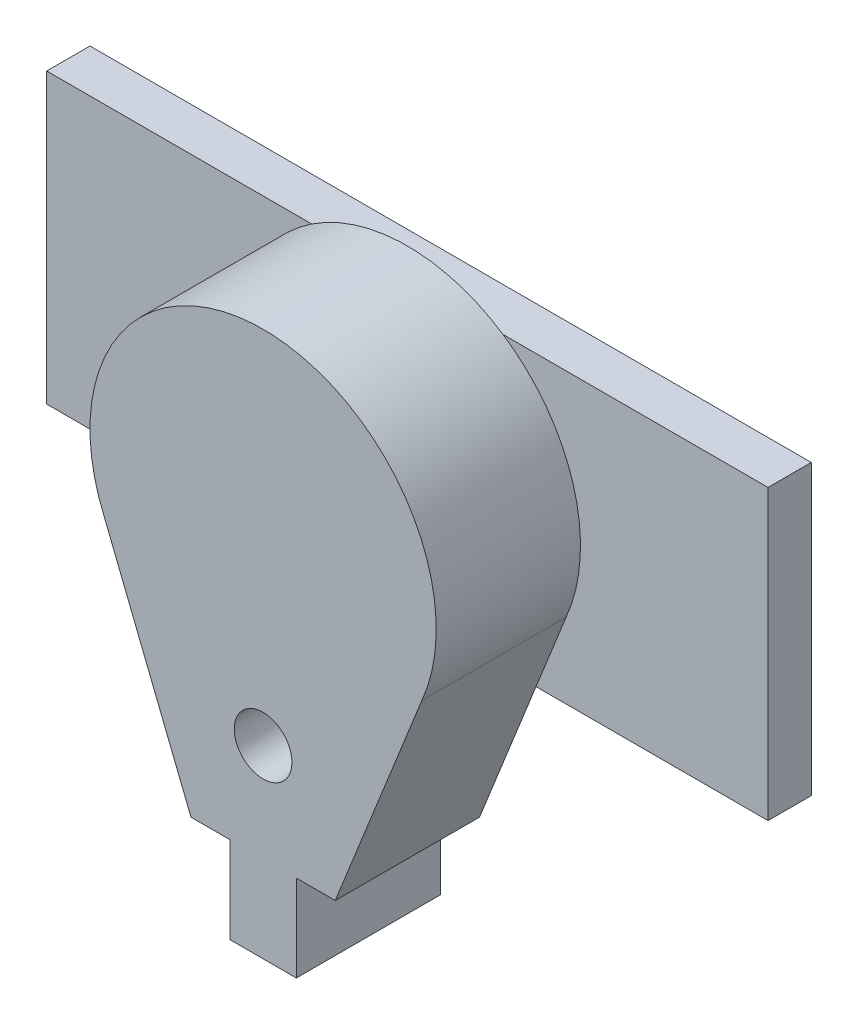
ISO-10303-21;
HEADER;
FILE_DESCRIPTION(('STEP AP214'),'2;1');
FILE_NAME('part.step','',(''),(''),'','','');
FILE_SCHEMA(('AUTOMOTIVE_DESIGN { 1 0 10303 214 1 1 1 1 }'));
ENDSEC;
DATA;
#1=APPLICATION_CONTEXT('core data for automotive mechanical design processes');
#2=APPLICATION_PROTOCOL_DEFINITION('international standard','automotive_design',2000,#1);
#3=PRODUCT_CONTEXT('',#1,'mechanical');
#4=PRODUCT('Part','Part','',(#3));
#5=PRODUCT_RELATED_PRODUCT_CATEGORY('part','',(#4));
#6=PRODUCT_DEFINITION_FORMATION('','',#4);
#7=PRODUCT_DEFINITION_CONTEXT('part definition',#1,'design');
#8=PRODUCT_DEFINITION('design','',#6,#7);
#9=PRODUCT_DEFINITION_SHAPE('','',#8);
#10=(LENGTH_UNIT() NAMED_UNIT(*) SI_UNIT(.MILLI.,.METRE.));
#11=(NAMED_UNIT(*) PLANE_ANGLE_UNIT() SI_UNIT($,.RADIAN.));
#12=(NAMED_UNIT(*) SI_UNIT($,.STERADIAN.) SOLID_ANGLE_UNIT());
#13=UNCERTAINTY_MEASURE_WITH_UNIT(LENGTH_MEASURE(1.E-05),#10,'distance_accuracy_value','');
#14=(GEOMETRIC_REPRESENTATION_CONTEXT(3) GLOBAL_UNCERTAINTY_ASSIGNED_CONTEXT((#13)) GLOBAL_UNIT_ASSIGNED_CONTEXT((#10,
#11,#12)) REPRESENTATION_CONTEXT('',''));
#15=CARTESIAN_POINT('',(0.,0.,0.));
#16=DIRECTION('',(0.,0.,1.));
#17=DIRECTION('',(1.,0.,0.));
#18=AXIS2_PLACEMENT_3D('',#15,#16,#17);
#19=CARTESIAN_POINT('',(0.,0.,0.));
#20=DIRECTION('',(0.,0.,-1.));
#21=DIRECTION('',(-1.,0.,0.));
#22=AXIS2_PLACEMENT_3D('',#19,#20,#21);
#23=PLANE('',#22);
#24=DIRECTION('',(-1.,0.,0.));
#25=VECTOR('',#24,1.);
#26=CARTESIAN_POINT('',(-25.,-10.,0.));
#27=LINE('',#26,#25);
#28=CARTESIAN_POINT('',(8.91833260932509,-10.,0.));
#29=VERTEX_POINT('',#28);
#30=CARTESIAN_POINT('',(-8.91833260932509,-10.,0.));
#31=VERTEX_POINT('',#30);
#32=EDGE_CURVE('E11',#29,#31,#27,.T.);
#33=ORIENTED_EDGE('',*,*,#32,.F.);
#34=DIRECTION('',(0.371390676354104,0.928476690885259,0.));
#35=VECTOR('',#34,1.);
#36=CARTESIAN_POINT('',(11.,-4.79583152331272,0.));
#37=LINE('',#36,#35);
#38=CARTESIAN_POINT('',(5.,-19.7958315233127,0.));
#39=VERTEX_POINT('',#38);
#40=EDGE_CURVE('E204',#39,#29,#37,.T.);
#41=ORIENTED_EDGE('',*,*,#40,.F.);
#42=DIRECTION('',(1.,0.,0.));
#43=VECTOR('',#42,1.);
#44=CARTESIAN_POINT('',(5.,-19.7958315233127,0.));
#45=LINE('',#44,#43);
#46=CARTESIAN_POINT('',(2.30529597079965,-19.7958315233127,0.));
#47=VERTEX_POINT('',#46);
#48=EDGE_CURVE('E218',#47,#39,#45,.T.);
#49=ORIENTED_EDGE('',*,*,#48,.F.);
#50=DIRECTION('',(0.,1.,0.));
#51=VECTOR('',#50,1.);
#52=CARTESIAN_POINT('',(2.30529597079965,-25.7958315233127,0.));
#53=LINE('',#52,#51);
#54=CARTESIAN_POINT('',(2.30529597079965,-25.7958315233127,0.));
#55=VERTEX_POINT('',#54);
#56=EDGE_CURVE('E187',#55,#47,#53,.T.);
#57=ORIENTED_EDGE('',*,*,#56,.F.);
#58=DIRECTION('',(1.,0.,0.));
#59=VECTOR('',#58,1.);
#60=CARTESIAN_POINT('',(2.30529597079965,-25.7958315233127,0.));
#61=LINE('',#60,#59);
#62=CARTESIAN_POINT('',(-2.30529597079965,-25.7958315233127,0.));
#63=VERTEX_POINT('',#62);
#64=EDGE_CURVE('E173',#63,#55,#61,.T.);
#65=ORIENTED_EDGE('',*,*,#64,.F.);
#66=DIRECTION('',(0.,1.,0.));
#67=VECTOR('',#66,1.);
#68=CARTESIAN_POINT('',(-2.30529597079965,-25.7958315233127,0.));
#69=LINE('',#68,#67);
#70=CARTESIAN_POINT('',(-2.30529597079965,-19.7958315233127,0.));
#71=VERTEX_POINT('',#70);
#72=EDGE_CURVE('E190',#63,#71,#69,.T.);
#73=ORIENTED_EDGE('',*,*,#72,.T.);
#74=CARTESIAN_POINT('',(-5.,-19.7958315233127,0.));
#75=VERTEX_POINT('',#74);
#76=EDGE_CURVE('E219',#75,#71,#45,.T.);
#77=ORIENTED_EDGE('',*,*,#76,.F.);
#78=DIRECTION('',(0.371390676354104,-0.928476690885259,0.));
#79=VECTOR('',#78,1.);
#80=CARTESIAN_POINT('',(-11.,-4.79583152331272,0.));
#81=LINE('',#80,#79);
#82=EDGE_CURVE('E52',#31,#75,#81,.T.);
#83=ORIENTED_EDGE('',*,*,#82,.F.);
#84=EDGE_LOOP('',(#33,#41,#49,#57,#65,#73,#77,#83));
#85=FACE_BOUND('',#84,.T.);
#86=CARTESIAN_POINT('',(0.,-13.,0.));
#87=DIRECTION('',(0.,0.,-1.));
#88=DIRECTION('',(-1.,0.,0.));
#89=AXIS2_PLACEMENT_3D('',#86,#87,#88);
#90=CIRCLE('',#89,2.);
#91=CARTESIAN_POINT('',(-2.,-13.,0.));
#92=VERTEX_POINT('',#91);
#93=EDGE_CURVE('E193',#92,#92,#90,.T.);
#94=ORIENTED_EDGE('',*,*,#93,.F.);
#95=EDGE_LOOP('',(#94));
#96=FACE_BOUND('',#95,.T.);
#97=ADVANCED_FACE('F33',(#85,#96),#23,.T.);
#98=CARTESIAN_POINT('',(5.,-19.7958315233127,10.));
#99=DIRECTION('',(0.,1.,0.));
#100=DIRECTION('',(0.,0.,1.));
#101=AXIS2_PLACEMENT_3D('',#98,#99,#100);
#102=PLANE('',#101);
#103=DIRECTION('',(0.,0.,-1.));
#104=VECTOR('',#103,1.);
#105=CARTESIAN_POINT('',(-2.30529597079965,-19.7958315233127,10.));
#106=LINE('',#105,#104);
#107=CARTESIAN_POINT('',(-2.30529597079965,-19.7958315233127,10.));
#108=VERTEX_POINT('',#107);
#109=EDGE_CURVE('E161',#108,#71,#106,.T.);
#110=ORIENTED_EDGE('',*,*,#109,.F.);
#111=DIRECTION('',(1.,0.,0.));
#112=VECTOR('',#111,1.);
#113=CARTESIAN_POINT('',(5.,-19.7958315233127,10.));
#114=LINE('',#113,#112);
#115=CARTESIAN_POINT('',(-5.,-19.7958315233127,10.));
#116=VERTEX_POINT('',#115);
#117=EDGE_CURVE('E207',#116,#108,#114,.T.);
#118=ORIENTED_EDGE('',*,*,#117,.F.);
#119=DIRECTION('',(0.,0.,-1.));
#120=VECTOR('',#119,1.);
#121=CARTESIAN_POINT('',(-5.,-19.7958315233127,10.));
#122=LINE('',#121,#120);
#123=EDGE_CURVE('E227',#116,#75,#122,.T.);
#124=ORIENTED_EDGE('',*,*,#123,.T.);
#125=ORIENTED_EDGE('',*,*,#76,.T.);
#126=EDGE_LOOP('',(#110,#118,#124,#125));
#127=FACE_BOUND('',#126,.T.);
#128=ADVANCED_FACE('F289',(#127),#102,.F.);
#129=DIRECTION('',(0.,0.,1.));
#130=VECTOR('',#129,1.);
#131=CARTESIAN_POINT('',(2.30529597079965,-19.7958315233127,10.));
#132=LINE('',#131,#130);
#133=CARTESIAN_POINT('',(2.30529597079965,-19.7958315233127,10.));
#134=VERTEX_POINT('',#133);
#135=EDGE_CURVE('E164',#47,#134,#132,.T.);
#136=ORIENTED_EDGE('',*,*,#135,.F.);
#137=ORIENTED_EDGE('',*,*,#48,.T.);
#138=DIRECTION('',(0.,0.,-1.));
#139=VECTOR('',#138,1.);
#140=CARTESIAN_POINT('',(5.,-19.7958315233127,10.));
#141=LINE('',#140,#139);
#142=CARTESIAN_POINT('',(5.,-19.7958315233127,10.));
#143=VERTEX_POINT('',#142);
#144=EDGE_CURVE('E225',#143,#39,#141,.T.);
#145=ORIENTED_EDGE('',*,*,#144,.F.);
#146=EDGE_CURVE('E206',#134,#143,#114,.T.);
#147=ORIENTED_EDGE('',*,*,#146,.F.);
#148=EDGE_LOOP('',(#136,#137,#145,#147));
#149=FACE_BOUND('',#148,.T.);
#150=ADVANCED_FACE('F291',(#149),#102,.F.);
#151=CARTESIAN_POINT('',(0.,0.,10.));
#152=DIRECTION('',(0.,0.,-1.));
#153=DIRECTION('',(-1.,0.,0.));
#154=AXIS2_PLACEMENT_3D('',#151,#152,#153);
#155=CYLINDRICAL_SURFACE('',#154,12.);
#156=CARTESIAN_POINT('',(0.,0.,0.));
#157=DIRECTION('',(0.,0.,1.));
#158=DIRECTION('',(-1.,0.,0.));
#159=AXIS2_PLACEMENT_3D('',#156,#157,#158);
#160=CIRCLE('',#159,12.);
#161=CARTESIAN_POINT('',(11.,-4.79583152331272,0.));
#162=VERTEX_POINT('',#161);
#163=CARTESIAN_POINT('',(6.6332495807108,10.,0.));
#164=VERTEX_POINT('',#163);
#165=EDGE_CURVE('E213',#162,#164,#160,.T.);
#166=ORIENTED_EDGE('',*,*,#165,.T.);
#167=CARTESIAN_POINT('',(-6.6332495807108,10.,0.));
#168=VERTEX_POINT('',#167);
#169=EDGE_CURVE('E215',#164,#168,#160,.T.);
#170=ORIENTED_EDGE('',*,*,#169,.T.);
#171=CARTESIAN_POINT('',(-11.,-4.79583152331272,0.));
#172=VERTEX_POINT('',#171);
#173=EDGE_CURVE('E197',#168,#172,#160,.T.);
#174=ORIENTED_EDGE('',*,*,#173,.T.);
#175=DIRECTION('',(0.,0.,-1.));
#176=VECTOR('',#175,1.);
#177=CARTESIAN_POINT('',(-11.,-4.79583152331272,10.));
#178=LINE('',#177,#176);
#179=CARTESIAN_POINT('',(-11.,-4.79583152331272,10.));
#180=VERTEX_POINT('',#179);
#181=EDGE_CURVE('E37',#180,#172,#178,.T.);
#182=ORIENTED_EDGE('',*,*,#181,.F.);
#183=CARTESIAN_POINT('',(0.,0.,10.));
#184=DIRECTION('',(0.,0.,1.));
#185=DIRECTION('',(-1.,0.,0.));
#186=AXIS2_PLACEMENT_3D('',#183,#184,#185);
#187=CIRCLE('',#186,12.);
#188=CARTESIAN_POINT('',(11.,-4.79583152331272,10.));
#189=VERTEX_POINT('',#188);
#190=EDGE_CURVE('E200',#189,#180,#187,.T.);
#191=ORIENTED_EDGE('',*,*,#190,.F.);
#192=DIRECTION('',(0.,0.,-1.));
#193=VECTOR('',#192,1.);
#194=CARTESIAN_POINT('',(11.,-4.79583152331272,10.));
#195=LINE('',#194,#193);
#196=EDGE_CURVE('E212',#189,#162,#195,.T.);
#197=ORIENTED_EDGE('',*,*,#196,.T.);
#198=EDGE_LOOP('',(#166,#170,#174,#182,#191,#197));
#199=FACE_BOUND('',#198,.T.);
#200=ADVANCED_FACE('F35',(#199),#155,.T.);
#201=CARTESIAN_POINT('',(-11.,-4.79583152331272,10.));
#202=DIRECTION('',(0.928476690885259,0.371390676354104,0.));
#203=DIRECTION('',(-0.371390676354104,0.928476690885259,0.));
#204=AXIS2_PLACEMENT_3D('',#201,#202,#203);
#205=PLANE('',#204);
#206=EDGE_CURVE('E216',#172,#31,#81,.T.);
#207=ORIENTED_EDGE('',*,*,#206,.T.);
#208=ORIENTED_EDGE('',*,*,#82,.T.);
#209=ORIENTED_EDGE('',*,*,#123,.F.);
#210=DIRECTION('',(0.371390676354104,-0.928476690885259,0.));
#211=VECTOR('',#210,1.);
#212=CARTESIAN_POINT('',(-11.,-4.79583152331272,10.));
#213=LINE('',#212,#211);
#214=EDGE_CURVE('E203',#180,#116,#213,.T.);
#215=ORIENTED_EDGE('',*,*,#214,.F.);
#216=ORIENTED_EDGE('',*,*,#181,.T.);
#217=EDGE_LOOP('',(#207,#208,#209,#215,#216));
#218=FACE_BOUND('',#217,.T.);
#219=ADVANCED_FACE('F300',(#218),#205,.F.);
#220=CARTESIAN_POINT('',(11.,-4.79583152331272,10.));
#221=DIRECTION('',(-0.928476690885259,0.371390676354104,0.));
#222=DIRECTION('',(-0.371390676354104,-0.928476690885259,0.));
#223=AXIS2_PLACEMENT_3D('',#220,#221,#222);
#224=PLANE('',#223);
#225=ORIENTED_EDGE('',*,*,#40,.T.);
#226=EDGE_CURVE('E221',#29,#162,#37,.T.);
#227=ORIENTED_EDGE('',*,*,#226,.T.);
#228=ORIENTED_EDGE('',*,*,#196,.F.);
#229=DIRECTION('',(0.371390676354104,0.928476690885259,0.));
#230=VECTOR('',#229,1.);
#231=CARTESIAN_POINT('',(11.,-4.79583152331272,10.));
#232=LINE('',#231,#230);
#233=EDGE_CURVE('E210',#143,#189,#232,.T.);
#234=ORIENTED_EDGE('',*,*,#233,.F.);
#235=ORIENTED_EDGE('',*,*,#144,.T.);
#236=EDGE_LOOP('',(#225,#227,#228,#234,#235));
#237=FACE_BOUND('',#236,.T.);
#238=ADVANCED_FACE('F264',(#237),#224,.F.);
#239=CARTESIAN_POINT('',(0.,0.,10.));
#240=DIRECTION('',(0.,0.,-1.));
#241=DIRECTION('',(-1.,0.,0.));
#242=AXIS2_PLACEMENT_3D('',#239,#240,#241);
#243=PLANE('',#242);
#244=CARTESIAN_POINT('',(0.,-13.,10.));
#245=DIRECTION('',(0.,0.,-1.));
#246=DIRECTION('',(-1.,0.,0.));
#247=AXIS2_PLACEMENT_3D('',#244,#245,#246);
#248=CIRCLE('',#247,2.);
#249=CARTESIAN_POINT('',(-2.,-13.,10.));
#250=VERTEX_POINT('',#249);
#251=EDGE_CURVE('E194',#250,#250,#248,.T.);
#252=ORIENTED_EDGE('',*,*,#251,.T.);
#253=EDGE_LOOP('',(#252));
#254=FACE_BOUND('',#253,.T.);
#255=ORIENTED_EDGE('',*,*,#190,.T.);
#256=ORIENTED_EDGE('',*,*,#214,.T.);
#257=ORIENTED_EDGE('',*,*,#117,.T.);
#258=DIRECTION('',(0.,1.,0.));
#259=VECTOR('',#258,1.);
#260=CARTESIAN_POINT('',(-2.30529597079965,-25.7958315233127,10.));
#261=LINE('',#260,#259);
#262=CARTESIAN_POINT('',(-2.30529597079965,-25.7958315233127,10.));
#263=VERTEX_POINT('',#262);
#264=EDGE_CURVE('E178',#263,#108,#261,.T.);
#265=ORIENTED_EDGE('',*,*,#264,.F.);
#266=DIRECTION('',(-1.,0.,0.));
#267=VECTOR('',#266,1.);
#268=CARTESIAN_POINT('',(2.30529597079965,-25.7958315233127,10.));
#269=LINE('',#268,#267);
#270=CARTESIAN_POINT('',(2.30529597079965,-25.7958315233127,10.));
#271=VERTEX_POINT('',#270);
#272=EDGE_CURVE('E177',#271,#263,#269,.T.);
#273=ORIENTED_EDGE('',*,*,#272,.F.);
#274=DIRECTION('',(0.,1.,0.));
#275=VECTOR('',#274,1.);
#276=CARTESIAN_POINT('',(2.30529597079965,-25.7958315233127,10.));
#277=LINE('',#276,#275);
#278=EDGE_CURVE('E184',#271,#134,#277,.T.);
#279=ORIENTED_EDGE('',*,*,#278,.T.);
#280=ORIENTED_EDGE('',*,*,#146,.T.);
#281=ORIENTED_EDGE('',*,*,#233,.T.);
#282=EDGE_LOOP('',(#255,#256,#257,#265,#273,#279,#280,#281));
#283=FACE_BOUND('',#282,.T.);
#284=ADVANCED_FACE('F271',(#254,#283),#243,.F.);
#285=DIRECTION('',(1.,0.,0.));
#286=VECTOR('',#285,1.);
#287=CARTESIAN_POINT('',(-25.,10.,0.));
#288=LINE('',#287,#286);
#289=EDGE_CURVE('E42',#168,#164,#288,.T.);
#290=ORIENTED_EDGE('',*,*,#289,.F.);
#291=ORIENTED_EDGE('',*,*,#169,.F.);
#292=EDGE_LOOP('',(#290,#291));
#293=FACE_BOUND('',#292,.T.);
#294=ADVANCED_FACE('F298',(#293),#23,.T.);
#295=CARTESIAN_POINT('',(0.,-13.,10.));
#296=DIRECTION('',(0.,0.,-1.));
#297=DIRECTION('',(-1.,0.,0.));
#298=AXIS2_PLACEMENT_3D('',#295,#296,#297);
#299=CYLINDRICAL_SURFACE('',#298,2.);
#300=ORIENTED_EDGE('',*,*,#251,.F.);
#301=EDGE_LOOP('',(#300));
#302=FACE_BOUND('',#301,.T.);
#303=ORIENTED_EDGE('',*,*,#93,.T.);
#304=EDGE_LOOP('',(#303));
#305=FACE_BOUND('',#304,.T.);
#306=ADVANCED_FACE('F311',(#302,#305),#299,.F.);
#307=CARTESIAN_POINT('',(-2.30529597079965,-25.7958315233127,10.));
#308=DIRECTION('',(1.,0.,0.));
#309=DIRECTION('',(0.,0.,-1.));
#310=AXIS2_PLACEMENT_3D('',#307,#308,#309);
#311=PLANE('',#310);
#312=ORIENTED_EDGE('',*,*,#109,.T.);
#313=ORIENTED_EDGE('',*,*,#72,.F.);
#314=DIRECTION('',(0.,0.,-1.));
#315=VECTOR('',#314,1.);
#316=CARTESIAN_POINT('',(-2.30529597079965,-25.7958315233127,10.));
#317=LINE('',#316,#315);
#318=EDGE_CURVE('E170',#263,#63,#317,.T.);
#319=ORIENTED_EDGE('',*,*,#318,.F.);
#320=ORIENTED_EDGE('',*,*,#264,.T.);
#321=EDGE_LOOP('',(#312,#313,#319,#320));
#322=FACE_BOUND('',#321,.T.);
#323=ADVANCED_FACE('F288',(#322),#311,.F.);
#324=CARTESIAN_POINT('',(2.30529597079965,-25.7958315233127,10.));
#325=DIRECTION('',(-1.,0.,0.));
#326=DIRECTION('',(0.,0.,1.));
#327=AXIS2_PLACEMENT_3D('',#324,#325,#326);
#328=PLANE('',#327);
#329=ORIENTED_EDGE('',*,*,#135,.T.);
#330=ORIENTED_EDGE('',*,*,#278,.F.);
#331=DIRECTION('',(0.,0.,1.));
#332=VECTOR('',#331,1.);
#333=CARTESIAN_POINT('',(2.30529597079965,-25.7958315233127,10.));
#334=LINE('',#333,#332);
#335=EDGE_CURVE('E175',#55,#271,#334,.T.);
#336=ORIENTED_EDGE('',*,*,#335,.F.);
#337=ORIENTED_EDGE('',*,*,#56,.T.);
#338=EDGE_LOOP('',(#329,#330,#336,#337));
#339=FACE_BOUND('',#338,.T.);
#340=ADVANCED_FACE('F279',(#339),#328,.F.);
#341=CARTESIAN_POINT('',(0.,-25.7958315233127,0.));
#342=DIRECTION('',(0.,1.,0.));
#343=DIRECTION('',(0.,0.,1.));
#344=AXIS2_PLACEMENT_3D('',#341,#342,#343);
#345=PLANE('',#344);
#346=ORIENTED_EDGE('',*,*,#318,.T.);
#347=ORIENTED_EDGE('',*,*,#64,.T.);
#348=ORIENTED_EDGE('',*,*,#335,.T.);
#349=ORIENTED_EDGE('',*,*,#272,.T.);
#350=EDGE_LOOP('',(#346,#347,#348,#349));
#351=FACE_BOUND('',#350,.T.);
#352=ADVANCED_FACE('F283',(#351),#345,.F.);
#353=CARTESIAN_POINT('',(0.,0.,0.));
#354=DIRECTION('',(0.,0.,-1.));
#355=DIRECTION('',(-1.,0.,0.));
#356=AXIS2_PLACEMENT_3D('',#353,#354,#355);
#357=PLANE('',#356);
#358=ORIENTED_EDGE('',*,*,#165,.F.);
#359=ORIENTED_EDGE('',*,*,#226,.F.);
#360=CARTESIAN_POINT('',(25.,-10.,0.));
#361=VERTEX_POINT('',#360);
#362=EDGE_CURVE('E44',#361,#29,#27,.T.);
#363=ORIENTED_EDGE('',*,*,#362,.F.);
#364=DIRECTION('',(0.,-1.,0.));
#365=VECTOR('',#364,1.);
#366=CARTESIAN_POINT('',(25.,-10.,0.));
#367=LINE('',#366,#365);
#368=CARTESIAN_POINT('',(25.,10.,0.));
#369=VERTEX_POINT('',#368);
#370=EDGE_CURVE('E242',#369,#361,#367,.T.);
#371=ORIENTED_EDGE('',*,*,#370,.F.);
#372=EDGE_CURVE('E239',#164,#369,#288,.T.);
#373=ORIENTED_EDGE('',*,*,#372,.F.);
#374=EDGE_LOOP('',(#358,#359,#363,#371,#373));
#375=FACE_BOUND('',#374,.T.);
#376=ADVANCED_FACE('F261',(#375),#357,.F.);
#377=CARTESIAN_POINT('',(-25.,-10.,-3.));
#378=DIRECTION('',(1.,0.,0.));
#379=DIRECTION('',(0.,0.,-1.));
#380=AXIS2_PLACEMENT_3D('',#377,#378,#379);
#381=PLANE('',#380);
#382=DIRECTION('',(0.,1.,0.));
#383=VECTOR('',#382,1.);
#384=CARTESIAN_POINT('',(-25.,-10.,0.));
#385=LINE('',#384,#383);
#386=CARTESIAN_POINT('',(-25.,-10.,0.));
#387=VERTEX_POINT('',#386);
#388=CARTESIAN_POINT('',(-25.,10.,0.));
#389=VERTEX_POINT('',#388);
#390=EDGE_CURVE('E160',#387,#389,#385,.T.);
#391=ORIENTED_EDGE('',*,*,#390,.T.);
#392=DIRECTION('',(0.,0.,1.));
#393=VECTOR('',#392,1.);
#394=CARTESIAN_POINT('',(-25.,10.,-3.));
#395=LINE('',#394,#393);
#396=CARTESIAN_POINT('',(-25.,10.,-3.));
#397=VERTEX_POINT('',#396);
#398=EDGE_CURVE('E141',#397,#389,#395,.T.);
#399=ORIENTED_EDGE('',*,*,#398,.F.);
#400=DIRECTION('',(0.,1.,0.));
#401=VECTOR('',#400,1.);
#402=CARTESIAN_POINT('',(-25.,-10.,-3.));
#403=LINE('',#402,#401);
#404=CARTESIAN_POINT('',(-25.,-10.,-3.));
#405=VERTEX_POINT('',#404);
#406=EDGE_CURVE('E148',#405,#397,#403,.T.);
#407=ORIENTED_EDGE('',*,*,#406,.F.);
#408=DIRECTION('',(0.,0.,1.));
#409=VECTOR('',#408,1.);
#410=CARTESIAN_POINT('',(-25.,-10.,-3.));
#411=LINE('',#410,#409);
#412=EDGE_CURVE('E246',#405,#387,#411,.T.);
#413=ORIENTED_EDGE('',*,*,#412,.T.);
#414=EDGE_LOOP('',(#391,#399,#407,#413));
#415=FACE_BOUND('',#414,.T.);
#416=ADVANCED_FACE('F158',(#415),#381,.F.);
#417=CARTESIAN_POINT('',(-25.,10.,-3.));
#418=DIRECTION('',(0.,-1.,0.));
#419=DIRECTION('',(1.,0.,0.));
#420=AXIS2_PLACEMENT_3D('',#417,#418,#419);
#421=PLANE('',#420);
#422=EDGE_CURVE('E238',#389,#168,#288,.T.);
#423=ORIENTED_EDGE('',*,*,#422,.T.);
#424=ORIENTED_EDGE('',*,*,#289,.T.);
#425=ORIENTED_EDGE('',*,*,#372,.T.);
#426=DIRECTION('',(0.,0.,1.));
#427=VECTOR('',#426,1.);
#428=CARTESIAN_POINT('',(25.,10.,-3.));
#429=LINE('',#428,#427);
#430=CARTESIAN_POINT('',(25.,10.,-3.));
#431=VERTEX_POINT('',#430);
#432=EDGE_CURVE('E144',#431,#369,#429,.T.);
#433=ORIENTED_EDGE('',*,*,#432,.F.);
#434=DIRECTION('',(1.,0.,0.));
#435=VECTOR('',#434,1.);
#436=CARTESIAN_POINT('',(-25.,10.,-3.));
#437=LINE('',#436,#435);
#438=EDGE_CURVE('E136',#397,#431,#437,.T.);
#439=ORIENTED_EDGE('',*,*,#438,.F.);
#440=ORIENTED_EDGE('',*,*,#398,.T.);
#441=EDGE_LOOP('',(#423,#424,#425,#433,#439,#440));
#442=FACE_BOUND('',#441,.T.);
#443=ADVANCED_FACE('F139',(#442),#421,.F.);
#444=CARTESIAN_POINT('',(25.,-10.,-3.));
#445=DIRECTION('',(-1.,0.,0.));
#446=DIRECTION('',(0.,-1.,0.));
#447=AXIS2_PLACEMENT_3D('',#444,#445,#446);
#448=PLANE('',#447);
#449=ORIENTED_EDGE('',*,*,#370,.T.);
#450=DIRECTION('',(0.,0.,1.));
#451=VECTOR('',#450,1.);
#452=CARTESIAN_POINT('',(25.,-10.,-3.));
#453=LINE('',#452,#451);
#454=CARTESIAN_POINT('',(25.,-10.,-3.));
#455=VERTEX_POINT('',#454);
#456=EDGE_CURVE('E166',#455,#361,#453,.T.);
#457=ORIENTED_EDGE('',*,*,#456,.F.);
#458=DIRECTION('',(0.,-1.,0.));
#459=VECTOR('',#458,1.);
#460=CARTESIAN_POINT('',(25.,-10.,-3.));
#461=LINE('',#460,#459);
#462=EDGE_CURVE('E147',#431,#455,#461,.T.);
#463=ORIENTED_EDGE('',*,*,#462,.F.);
#464=ORIENTED_EDGE('',*,*,#432,.T.);
#465=EDGE_LOOP('',(#449,#457,#463,#464));
#466=FACE_BOUND('',#465,.T.);
#467=ADVANCED_FACE('F250',(#466),#448,.F.);
#468=CARTESIAN_POINT('',(-25.,-10.,-3.));
#469=DIRECTION('',(0.,1.,0.));
#470=DIRECTION('',(-1.,0.,0.));
#471=AXIS2_PLACEMENT_3D('',#468,#469,#470);
#472=PLANE('',#471);
#473=ORIENTED_EDGE('',*,*,#362,.T.);
#474=ORIENTED_EDGE('',*,*,#32,.T.);
#475=EDGE_CURVE('E45',#31,#387,#27,.T.);
#476=ORIENTED_EDGE('',*,*,#475,.T.);
#477=ORIENTED_EDGE('',*,*,#412,.F.);
#478=DIRECTION('',(-1.,0.,0.));
#479=VECTOR('',#478,1.);
#480=CARTESIAN_POINT('',(-25.,-10.,-3.));
#481=LINE('',#480,#479);
#482=EDGE_CURVE('E153',#455,#405,#481,.T.);
#483=ORIENTED_EDGE('',*,*,#482,.F.);
#484=ORIENTED_EDGE('',*,*,#456,.T.);
#485=EDGE_LOOP('',(#473,#474,#476,#477,#483,#484));
#486=FACE_BOUND('',#485,.T.);
#487=ADVANCED_FACE('F255',(#486),#472,.F.);
#488=CARTESIAN_POINT('',(0.,0.,-3.));
#489=DIRECTION('',(0.,0.,-1.));
#490=DIRECTION('',(-1.,0.,0.));
#491=AXIS2_PLACEMENT_3D('',#488,#489,#490);
#492=PLANE('',#491);
#493=ORIENTED_EDGE('',*,*,#406,.T.);
#494=ORIENTED_EDGE('',*,*,#438,.T.);
#495=ORIENTED_EDGE('',*,*,#462,.T.);
#496=ORIENTED_EDGE('',*,*,#482,.T.);
#497=EDGE_LOOP('',(#493,#494,#495,#496));
#498=FACE_BOUND('',#497,.T.);
#499=ADVANCED_FACE('F151',(#498),#492,.T.);
#500=ORIENTED_EDGE('',*,*,#173,.F.);
#501=ORIENTED_EDGE('',*,*,#422,.F.);
#502=ORIENTED_EDGE('',*,*,#390,.F.);
#503=ORIENTED_EDGE('',*,*,#475,.F.);
#504=ORIENTED_EDGE('',*,*,#206,.F.);
#505=EDGE_LOOP('',(#500,#501,#502,#503,#504));
#506=FACE_BOUND('',#505,.T.);
#507=ADVANCED_FACE('F308',(#506),#357,.F.);
#508=CLOSED_SHELL('',(#97,#128,#150,#200,#219,#238,#284,#294,#306,#323,#340,#352,#376,#416,#443,
#467,#487,#499,#507));
#509=MANIFOLD_SOLID_BREP('B2',#508);
#510=ADVANCED_BREP_SHAPE_REPRESENTATION('',(#18,#509),#14);
#511=SHAPE_DEFINITION_REPRESENTATION(#9,#510);
ENDSEC;
END-ISO-10303-21;
